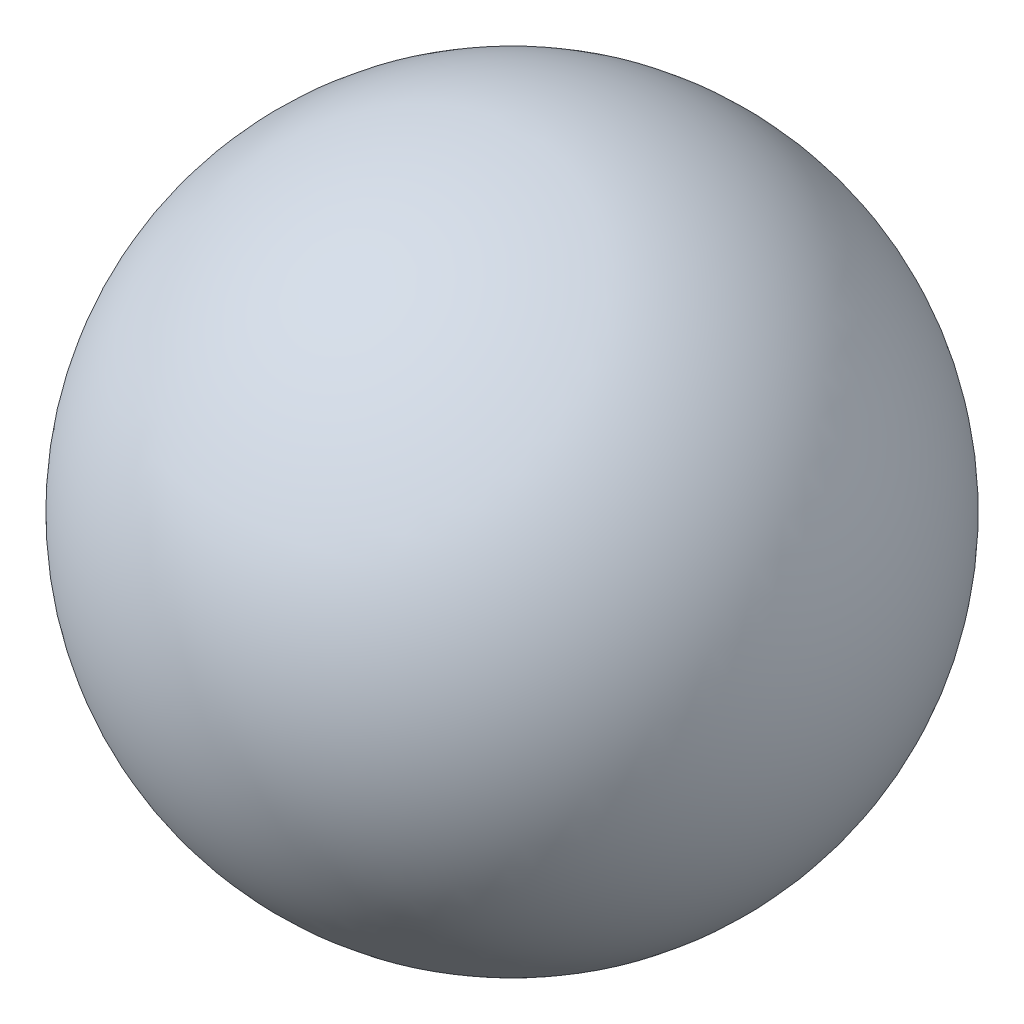
ISO-10303-21;
HEADER;
FILE_DESCRIPTION(('STEP AP214'),'2;1');
FILE_NAME('part.step','',(''),(''),'','','');
FILE_SCHEMA(('AUTOMOTIVE_DESIGN { 1 0 10303 214 1 1 1 1 }'));
ENDSEC;
DATA;
#1=APPLICATION_CONTEXT('core data for automotive mechanical design processes');
#2=APPLICATION_PROTOCOL_DEFINITION('international standard','automotive_design',2000,#1);
#3=PRODUCT_CONTEXT('',#1,'mechanical');
#4=PRODUCT('Part','Part','',(#3));
#5=PRODUCT_RELATED_PRODUCT_CATEGORY('part','',(#4));
#6=PRODUCT_DEFINITION_FORMATION('','',#4);
#7=PRODUCT_DEFINITION_CONTEXT('part definition',#1,'design');
#8=PRODUCT_DEFINITION('design','',#6,#7);
#9=PRODUCT_DEFINITION_SHAPE('','',#8);
#10=(LENGTH_UNIT() NAMED_UNIT(*) SI_UNIT(.MILLI.,.METRE.));
#11=(NAMED_UNIT(*) PLANE_ANGLE_UNIT() SI_UNIT($,.RADIAN.));
#12=(NAMED_UNIT(*) SI_UNIT($,.STERADIAN.) SOLID_ANGLE_UNIT());
#13=UNCERTAINTY_MEASURE_WITH_UNIT(LENGTH_MEASURE(1.E-05),#10,'distance_accuracy_value','');
#14=(GEOMETRIC_REPRESENTATION_CONTEXT(3) GLOBAL_UNCERTAINTY_ASSIGNED_CONTEXT((#13)) GLOBAL_UNIT_ASSIGNED_CONTEXT((#10,
#11,#12)) REPRESENTATION_CONTEXT('',''));
#15=CARTESIAN_POINT('',(0.,0.,0.));
#16=DIRECTION('',(0.,0.,1.));
#17=DIRECTION('',(1.,0.,0.));
#18=AXIS2_PLACEMENT_3D('',#15,#16,#17);
#19=CARTESIAN_POINT('',(0.,0.,0.));
#20=DIRECTION('',(0.,1.,0.));
#21=DIRECTION('',(-1.,0.,0.));
#22=AXIS2_PLACEMENT_3D('',#19,#20,#21);
#23=SPHERICAL_SURFACE('',#22,10.);
#24=CARTESIAN_POINT('',(0.,10.,0.));
#25=VERTEX_POINT('',#24);
#26=VERTEX_LOOP('',#25);
#27=FACE_BOUND('',#26,.T.);
#28=ADVANCED_FACE('F47',(#27),#23,.T.);
#29=CLOSED_SHELL('',(#28));
#30=MANIFOLD_SOLID_BREP('B2',#29);
#31=CARTESIAN_POINT('',(5.,5.,2.5));
#32=DIRECTION('',(-1.,0.,0.));
#33=DIRECTION('',(0.,-1.,0.));
#34=AXIS2_PLACEMENT_3D('',#31,#32,#33);
#35=PLANE('',#34);
#36=DIRECTION('',(0.,1.,0.));
#37=VECTOR('',#36,1.);
#38=CARTESIAN_POINT('',(5.,5.,-2.5));
#39=LINE('',#38,#37);
#40=CARTESIAN_POINT('',(5.,2.5,-2.5));
#41=VERTEX_POINT('',#40);
#42=CARTESIAN_POINT('',(5.,5.,-2.5));
#43=VERTEX_POINT('',#42);
#44=EDGE_CURVE('E186',#41,#43,#39,.T.);
#45=ORIENTED_EDGE('',*,*,#44,.T.);
#46=DIRECTION('',(0.,0.,-1.));
#47=VECTOR('',#46,1.);
#48=CARTESIAN_POINT('',(5.,5.,2.5));
#49=LINE('',#48,#47);
#50=CARTESIAN_POINT('',(5.,5.,2.5));
#51=VERTEX_POINT('',#50);
#52=EDGE_CURVE('E45',#51,#43,#49,.T.);
#53=ORIENTED_EDGE('',*,*,#52,.F.);
#54=DIRECTION('',(0.,1.,0.));
#55=VECTOR('',#54,1.);
#56=CARTESIAN_POINT('',(5.,5.,2.5));
#57=LINE('',#56,#55);
#58=CARTESIAN_POINT('',(5.,2.5,2.5));
#59=VERTEX_POINT('',#58);
#60=EDGE_CURVE('E214',#59,#51,#57,.T.);
#61=ORIENTED_EDGE('',*,*,#60,.F.);
#62=DIRECTION('',(0.,0.,-1.));
#63=VECTOR('',#62,1.);
#64=CARTESIAN_POINT('',(5.,2.5,2.5));
#65=LINE('',#64,#63);
#66=EDGE_CURVE('E182',#59,#41,#65,.T.);
#67=ORIENTED_EDGE('',*,*,#66,.T.);
#68=EDGE_LOOP('',(#45,#53,#61,#67));
#69=FACE_BOUND('',#68,.T.);
#70=ADVANCED_FACE('F61',(#69),#35,.F.);
#71=CARTESIAN_POINT('',(-1.875,5.,2.5));
#72=DIRECTION('',(0.,-1.,0.));
#73=DIRECTION('',(1.,0.,0.));
#74=AXIS2_PLACEMENT_3D('',#71,#72,#73);
#75=PLANE('',#74);
#76=DIRECTION('',(-1.,0.,0.));
#77=VECTOR('',#76,1.);
#78=CARTESIAN_POINT('',(-1.875,5.,-2.5));
#79=LINE('',#78,#77);
#80=CARTESIAN_POINT('',(-1.875,5.,-2.5));
#81=VERTEX_POINT('',#80);
#82=EDGE_CURVE('E189',#43,#81,#79,.T.);
#83=ORIENTED_EDGE('',*,*,#82,.T.);
#84=DIRECTION('',(0.,0.,-1.));
#85=VECTOR('',#84,1.);
#86=CARTESIAN_POINT('',(-1.875,5.,2.5));
#87=LINE('',#86,#85);
#88=CARTESIAN_POINT('',(-1.875,5.,2.5));
#89=VERTEX_POINT('',#88);
#90=EDGE_CURVE('E69',#89,#81,#87,.T.);
#91=ORIENTED_EDGE('',*,*,#90,.F.);
#92=DIRECTION('',(-1.,0.,0.));
#93=VECTOR('',#92,1.);
#94=CARTESIAN_POINT('',(-1.875,5.,2.5));
#95=LINE('',#94,#93);
#96=EDGE_CURVE('E135',#51,#89,#95,.T.);
#97=ORIENTED_EDGE('',*,*,#96,.F.);
#98=ORIENTED_EDGE('',*,*,#52,.T.);
#99=EDGE_LOOP('',(#83,#91,#97,#98));
#100=FACE_BOUND('',#99,.T.);
#101=ADVANCED_FACE('F278',(#100),#75,.F.);
#102=CARTESIAN_POINT('',(-1.875,1.875,2.5));
#103=DIRECTION('',(0.,0.,-1.));
#104=DIRECTION('',(-1.,0.,0.));
#105=AXIS2_PLACEMENT_3D('',#102,#103,#104);
#106=CYLINDRICAL_SURFACE('',#105,3.125);
#107=CARTESIAN_POINT('',(-1.875,1.875,-2.5));
#108=DIRECTION('',(0.,0.,1.));
#109=DIRECTION('',(-1.,0.,0.));
#110=AXIS2_PLACEMENT_3D('',#107,#108,#109);
#111=CIRCLE('',#110,3.125);
#112=CARTESIAN_POINT('',(-1.875,-1.25,-2.5));
#113=VERTEX_POINT('',#112);
#114=EDGE_CURVE('E191',#81,#113,#111,.T.);
#115=ORIENTED_EDGE('',*,*,#114,.T.);
#116=DIRECTION('',(0.,0.,-1.));
#117=VECTOR('',#116,1.);
#118=CARTESIAN_POINT('',(-1.875,-1.25,2.5));
#119=LINE('',#118,#117);
#120=CARTESIAN_POINT('',(-1.875,-1.25,2.5));
#121=VERTEX_POINT('',#120);
#122=EDGE_CURVE('E236',#121,#113,#119,.T.);
#123=ORIENTED_EDGE('',*,*,#122,.F.);
#124=CARTESIAN_POINT('',(-1.875,1.875,2.5));
#125=DIRECTION('',(0.,0.,1.));
#126=DIRECTION('',(-1.,0.,0.));
#127=AXIS2_PLACEMENT_3D('',#124,#125,#126);
#128=CIRCLE('',#127,3.125);
#129=EDGE_CURVE('E245',#89,#121,#128,.T.);
#130=ORIENTED_EDGE('',*,*,#129,.F.);
#131=ORIENTED_EDGE('',*,*,#90,.T.);
#132=EDGE_LOOP('',(#115,#123,#130,#131));
#133=FACE_BOUND('',#132,.T.);
#134=ADVANCED_FACE('F243',(#133),#106,.T.);
#135=CARTESIAN_POINT('',(1.875,-1.25,2.5));
#136=DIRECTION('',(0.,1.,0.));
#137=DIRECTION('',(0.,0.,1.));
#138=AXIS2_PLACEMENT_3D('',#135,#136,#137);
#139=PLANE('',#138);
#140=DIRECTION('',(1.,0.,0.));
#141=VECTOR('',#140,1.);
#142=CARTESIAN_POINT('',(1.875,-1.25,-2.5));
#143=LINE('',#142,#141);
#144=CARTESIAN_POINT('',(1.875,-1.25,-2.5));
#145=VERTEX_POINT('',#144);
#146=EDGE_CURVE('E195',#113,#145,#143,.T.);
#147=ORIENTED_EDGE('',*,*,#146,.T.);
#148=DIRECTION('',(0.,0.,-1.));
#149=VECTOR('',#148,1.);
#150=CARTESIAN_POINT('',(1.875,-1.25,2.5));
#151=LINE('',#150,#149);
#152=CARTESIAN_POINT('',(1.875,-1.25,2.5));
#153=VERTEX_POINT('',#152);
#154=EDGE_CURVE('E232',#153,#145,#151,.T.);
#155=ORIENTED_EDGE('',*,*,#154,.F.);
#156=DIRECTION('',(1.,0.,0.));
#157=VECTOR('',#156,1.);
#158=CARTESIAN_POINT('',(0.,-1.25,2.5));
#159=LINE('',#158,#157);
#160=EDGE_CURVE('E262',#121,#153,#159,.T.);
#161=ORIENTED_EDGE('',*,*,#160,.F.);
#162=ORIENTED_EDGE('',*,*,#122,.T.);
#163=EDGE_LOOP('',(#147,#155,#161,#162));
#164=FACE_BOUND('',#163,.T.);
#165=ADVANCED_FACE('F253',(#164),#139,.F.);
#166=CARTESIAN_POINT('',(1.875,-1.875,2.5));
#167=DIRECTION('',(0.,0.,-1.));
#168=DIRECTION('',(-1.,0.,0.));
#169=AXIS2_PLACEMENT_3D('',#166,#167,#168);
#170=CYLINDRICAL_SURFACE('',#169,0.625);
#171=CARTESIAN_POINT('',(1.875,-1.875,-2.5));
#172=DIRECTION('',(0.,0.,-1.));
#173=DIRECTION('',(-1.,0.,0.));
#174=AXIS2_PLACEMENT_3D('',#171,#172,#173);
#175=CIRCLE('',#174,0.625);
#176=CARTESIAN_POINT('',(1.875,-2.5,-2.5));
#177=VERTEX_POINT('',#176);
#178=EDGE_CURVE('E198',#145,#177,#175,.T.);
#179=ORIENTED_EDGE('',*,*,#178,.T.);
#180=DIRECTION('',(0.,0.,-1.));
#181=VECTOR('',#180,1.);
#182=CARTESIAN_POINT('',(1.875,-2.5,2.5));
#183=LINE('',#182,#181);
#184=CARTESIAN_POINT('',(1.875,-2.5,2.5));
#185=VERTEX_POINT('',#184);
#186=EDGE_CURVE('E229',#185,#177,#183,.T.);
#187=ORIENTED_EDGE('',*,*,#186,.F.);
#188=CARTESIAN_POINT('',(1.875,-1.875,2.5));
#189=DIRECTION('',(0.,0.,-1.));
#190=DIRECTION('',(-1.,0.,0.));
#191=AXIS2_PLACEMENT_3D('',#188,#189,#190);
#192=CIRCLE('',#191,0.625);
#193=EDGE_CURVE('E259',#153,#185,#192,.T.);
#194=ORIENTED_EDGE('',*,*,#193,.F.);
#195=ORIENTED_EDGE('',*,*,#154,.T.);
#196=EDGE_LOOP('',(#179,#187,#194,#195));
#197=FACE_BOUND('',#196,.T.);
#198=ADVANCED_FACE('F257',(#197),#170,.F.);
#199=CARTESIAN_POINT('',(1.875,-2.5,2.5));
#200=DIRECTION('',(0.,-1.,0.));
#201=DIRECTION('',(0.,0.,-1.));
#202=AXIS2_PLACEMENT_3D('',#199,#200,#201);
#203=PLANE('',#202);
#204=DIRECTION('',(-1.,0.,0.));
#205=VECTOR('',#204,1.);
#206=CARTESIAN_POINT('',(1.875,-2.5,-2.5));
#207=LINE('',#206,#205);
#208=CARTESIAN_POINT('',(-5.,-2.5,-2.5));
#209=VERTEX_POINT('',#208);
#210=EDGE_CURVE('E201',#177,#209,#207,.T.);
#211=ORIENTED_EDGE('',*,*,#210,.T.);
#212=DIRECTION('',(0.,0.,-1.));
#213=VECTOR('',#212,1.);
#214=CARTESIAN_POINT('',(-5.,-2.5,2.5));
#215=LINE('',#214,#213);
#216=CARTESIAN_POINT('',(-5.,-2.5,2.5));
#217=VERTEX_POINT('',#216);
#218=EDGE_CURVE('E226',#217,#209,#215,.T.);
#219=ORIENTED_EDGE('',*,*,#218,.F.);
#220=DIRECTION('',(-1.,0.,0.));
#221=VECTOR('',#220,1.);
#222=CARTESIAN_POINT('',(1.875,-2.5,2.5));
#223=LINE('',#222,#221);
#224=EDGE_CURVE('E261',#185,#217,#223,.T.);
#225=ORIENTED_EDGE('',*,*,#224,.F.);
#226=ORIENTED_EDGE('',*,*,#186,.T.);
#227=EDGE_LOOP('',(#211,#219,#225,#226));
#228=FACE_BOUND('',#227,.T.);
#229=ADVANCED_FACE('F290',(#228),#203,.F.);
#230=CARTESIAN_POINT('',(-5.,-2.5,2.5));
#231=DIRECTION('',(1.,0.,0.));
#232=DIRECTION('',(0.,1.,0.));
#233=AXIS2_PLACEMENT_3D('',#230,#231,#232);
#234=PLANE('',#233);
#235=DIRECTION('',(0.,-1.,0.));
#236=VECTOR('',#235,1.);
#237=CARTESIAN_POINT('',(-5.,-2.5,-2.5));
#238=LINE('',#237,#236);
#239=CARTESIAN_POINT('',(-5.,-5.,-2.5));
#240=VERTEX_POINT('',#239);
#241=EDGE_CURVE('E204',#209,#240,#238,.T.);
#242=ORIENTED_EDGE('',*,*,#241,.T.);
#243=DIRECTION('',(0.,0.,-1.));
#244=VECTOR('',#243,1.);
#245=CARTESIAN_POINT('',(-5.,-5.,2.5));
#246=LINE('',#245,#244);
#247=CARTESIAN_POINT('',(-5.,-5.,2.5));
#248=VERTEX_POINT('',#247);
#249=EDGE_CURVE('E223',#248,#240,#246,.T.);
#250=ORIENTED_EDGE('',*,*,#249,.F.);
#251=DIRECTION('',(0.,-1.,0.));
#252=VECTOR('',#251,1.);
#253=CARTESIAN_POINT('',(-5.,-2.5,2.5));
#254=LINE('',#253,#252);
#255=EDGE_CURVE('E264',#217,#248,#254,.T.);
#256=ORIENTED_EDGE('',*,*,#255,.F.);
#257=ORIENTED_EDGE('',*,*,#218,.T.);
#258=EDGE_LOOP('',(#242,#250,#256,#257));
#259=FACE_BOUND('',#258,.T.);
#260=ADVANCED_FACE('F293',(#259),#234,.F.);
#261=CARTESIAN_POINT('',(-5.,-5.,2.5));
#262=DIRECTION('',(0.,1.,0.));
#263=DIRECTION('',(0.,0.,1.));
#264=AXIS2_PLACEMENT_3D('',#261,#262,#263);
#265=PLANE('',#264);
#266=DIRECTION('',(1.,0.,0.));
#267=VECTOR('',#266,1.);
#268=CARTESIAN_POINT('',(-5.,-5.,-2.5));
#269=LINE('',#268,#267);
#270=CARTESIAN_POINT('',(1.875,-5.,-2.5));
#271=VERTEX_POINT('',#270);
#272=EDGE_CURVE('E206',#240,#271,#269,.T.);
#273=ORIENTED_EDGE('',*,*,#272,.T.);
#274=DIRECTION('',(0.,0.,-1.));
#275=VECTOR('',#274,1.);
#276=CARTESIAN_POINT('',(1.875,-5.,2.5));
#277=LINE('',#276,#275);
#278=CARTESIAN_POINT('',(1.875,-5.,2.5));
#279=VERTEX_POINT('',#278);
#280=EDGE_CURVE('E220',#279,#271,#277,.T.);
#281=ORIENTED_EDGE('',*,*,#280,.F.);
#282=DIRECTION('',(1.,0.,0.));
#283=VECTOR('',#282,1.);
#284=CARTESIAN_POINT('',(-5.,-5.,2.5));
#285=LINE('',#284,#283);
#286=EDGE_CURVE('E270',#248,#279,#285,.T.);
#287=ORIENTED_EDGE('',*,*,#286,.F.);
#288=ORIENTED_EDGE('',*,*,#249,.T.);
#289=EDGE_LOOP('',(#273,#281,#287,#288));
#290=FACE_BOUND('',#289,.T.);
#291=ADVANCED_FACE('F297',(#290),#265,.F.);
#292=CARTESIAN_POINT('',(1.875,-1.875,2.5));
#293=DIRECTION('',(0.,0.,-1.));
#294=DIRECTION('',(-1.,0.,0.));
#295=AXIS2_PLACEMENT_3D('',#292,#293,#294);
#296=CYLINDRICAL_SURFACE('',#295,3.125);
#297=CARTESIAN_POINT('',(1.875,-1.875,-2.5));
#298=DIRECTION('',(0.,0.,1.));
#299=DIRECTION('',(-1.,0.,0.));
#300=AXIS2_PLACEMENT_3D('',#297,#298,#299);
#301=CIRCLE('',#300,3.125);
#302=CARTESIAN_POINT('',(1.875,1.25,-2.5));
#303=VERTEX_POINT('',#302);
#304=EDGE_CURVE('E208',#271,#303,#301,.T.);
#305=ORIENTED_EDGE('',*,*,#304,.T.);
#306=DIRECTION('',(0.,0.,-1.));
#307=VECTOR('',#306,1.);
#308=CARTESIAN_POINT('',(1.875,1.25,2.5));
#309=LINE('',#308,#307);
#310=CARTESIAN_POINT('',(1.875,1.25,2.5));
#311=VERTEX_POINT('',#310);
#312=EDGE_CURVE('E176',#311,#303,#309,.T.);
#313=ORIENTED_EDGE('',*,*,#312,.F.);
#314=CARTESIAN_POINT('',(1.875,-1.875,2.5));
#315=DIRECTION('',(0.,0.,1.));
#316=DIRECTION('',(-1.,0.,0.));
#317=AXIS2_PLACEMENT_3D('',#314,#315,#316);
#318=CIRCLE('',#317,3.125);
#319=EDGE_CURVE('E167',#279,#311,#318,.T.);
#320=ORIENTED_EDGE('',*,*,#319,.F.);
#321=ORIENTED_EDGE('',*,*,#280,.T.);
#322=EDGE_LOOP('',(#305,#313,#320,#321));
#323=FACE_BOUND('',#322,.T.);
#324=ADVANCED_FACE('F301',(#323),#296,.T.);
#325=CARTESIAN_POINT('',(-1.875,1.25,2.5));
#326=DIRECTION('',(0.,-1.,0.));
#327=DIRECTION('',(0.,0.,-1.));
#328=AXIS2_PLACEMENT_3D('',#325,#326,#327);
#329=PLANE('',#328);
#330=DIRECTION('',(-1.,0.,0.));
#331=VECTOR('',#330,1.);
#332=CARTESIAN_POINT('',(-1.875,1.25,-2.5));
#333=LINE('',#332,#331);
#334=CARTESIAN_POINT('',(-1.875,1.25,-2.5));
#335=VERTEX_POINT('',#334);
#336=EDGE_CURVE('E175',#303,#335,#333,.T.);
#337=ORIENTED_EDGE('',*,*,#336,.T.);
#338=DIRECTION('',(0.,0.,-1.));
#339=VECTOR('',#338,1.);
#340=CARTESIAN_POINT('',(-1.875,1.25,2.5));
#341=LINE('',#340,#339);
#342=CARTESIAN_POINT('',(-1.875,1.25,2.5));
#343=VERTEX_POINT('',#342);
#344=EDGE_CURVE('E173',#343,#335,#341,.T.);
#345=ORIENTED_EDGE('',*,*,#344,.F.);
#346=DIRECTION('',(-1.,0.,0.));
#347=VECTOR('',#346,1.);
#348=CARTESIAN_POINT('',(0.,1.25,2.5));
#349=LINE('',#348,#347);
#350=EDGE_CURVE('E161',#311,#343,#349,.T.);
#351=ORIENTED_EDGE('',*,*,#350,.F.);
#352=ORIENTED_EDGE('',*,*,#312,.T.);
#353=EDGE_LOOP('',(#337,#345,#351,#352));
#354=FACE_BOUND('',#353,.T.);
#355=ADVANCED_FACE('F174',(#354),#329,.F.);
#356=CARTESIAN_POINT('',(-1.875,1.875,2.5));
#357=DIRECTION('',(0.,0.,-1.));
#358=DIRECTION('',(-1.,0.,0.));
#359=AXIS2_PLACEMENT_3D('',#356,#357,#358);
#360=CYLINDRICAL_SURFACE('',#359,0.625);
#361=CARTESIAN_POINT('',(-1.875,1.875,-2.5));
#362=DIRECTION('',(0.,0.,-1.));
#363=DIRECTION('',(1.,0.,0.));
#364=AXIS2_PLACEMENT_3D('',#361,#362,#363);
#365=CIRCLE('',#364,0.625);
#366=CARTESIAN_POINT('',(-1.875,2.5,-2.5));
#367=VERTEX_POINT('',#366);
#368=EDGE_CURVE('E121',#335,#367,#365,.T.);
#369=ORIENTED_EDGE('',*,*,#368,.T.);
#370=DIRECTION('',(0.,0.,-1.));
#371=VECTOR('',#370,1.);
#372=CARTESIAN_POINT('',(-1.875,2.5,2.5));
#373=LINE('',#372,#371);
#374=CARTESIAN_POINT('',(-1.875,2.5,2.5));
#375=VERTEX_POINT('',#374);
#376=EDGE_CURVE('E177',#375,#367,#373,.T.);
#377=ORIENTED_EDGE('',*,*,#376,.F.);
#378=CARTESIAN_POINT('',(-1.875,1.875,2.5));
#379=DIRECTION('',(0.,0.,-1.));
#380=DIRECTION('',(1.,0.,0.));
#381=AXIS2_PLACEMENT_3D('',#378,#379,#380);
#382=CIRCLE('',#381,0.625);
#383=EDGE_CURVE('E165',#343,#375,#382,.T.);
#384=ORIENTED_EDGE('',*,*,#383,.F.);
#385=ORIENTED_EDGE('',*,*,#344,.T.);
#386=EDGE_LOOP('',(#369,#377,#384,#385));
#387=FACE_BOUND('',#386,.T.);
#388=ADVANCED_FACE('F179',(#387),#360,.F.);
#389=CARTESIAN_POINT('',(5.,2.5,2.5));
#390=DIRECTION('',(0.,1.,0.));
#391=DIRECTION('',(-1.,0.,0.));
#392=AXIS2_PLACEMENT_3D('',#389,#390,#391);
#393=PLANE('',#392);
#394=DIRECTION('',(1.,0.,0.));
#395=VECTOR('',#394,1.);
#396=CARTESIAN_POINT('',(5.,2.5,-2.5));
#397=LINE('',#396,#395);
#398=EDGE_CURVE('E127',#367,#41,#397,.T.);
#399=ORIENTED_EDGE('',*,*,#398,.T.);
#400=ORIENTED_EDGE('',*,*,#66,.F.);
#401=DIRECTION('',(1.,0.,0.));
#402=VECTOR('',#401,1.);
#403=CARTESIAN_POINT('',(5.,2.5,2.5));
#404=LINE('',#403,#402);
#405=EDGE_CURVE('E80',#375,#59,#404,.T.);
#406=ORIENTED_EDGE('',*,*,#405,.F.);
#407=ORIENTED_EDGE('',*,*,#376,.T.);
#408=EDGE_LOOP('',(#399,#400,#406,#407));
#409=FACE_BOUND('',#408,.T.);
#410=ADVANCED_FACE('F310',(#409),#393,.F.);
#411=CARTESIAN_POINT('',(-1.875,1.875,2.5));
#412=DIRECTION('',(0.,0.,1.));
#413=DIRECTION('',(1.,0.,0.));
#414=AXIS2_PLACEMENT_3D('',#411,#412,#413);
#415=PLANE('',#414);
#416=ORIENTED_EDGE('',*,*,#60,.T.);
#417=ORIENTED_EDGE('',*,*,#96,.T.);
#418=ORIENTED_EDGE('',*,*,#129,.T.);
#419=ORIENTED_EDGE('',*,*,#160,.T.);
#420=ORIENTED_EDGE('',*,*,#193,.T.);
#421=ORIENTED_EDGE('',*,*,#224,.T.);
#422=ORIENTED_EDGE('',*,*,#255,.T.);
#423=ORIENTED_EDGE('',*,*,#286,.T.);
#424=ORIENTED_EDGE('',*,*,#319,.T.);
#425=ORIENTED_EDGE('',*,*,#350,.T.);
#426=ORIENTED_EDGE('',*,*,#383,.T.);
#427=ORIENTED_EDGE('',*,*,#405,.T.);
#428=EDGE_LOOP('',(#416,#417,#418,#419,#420,#421,#422,#423,#424,#425,#426,#427));
#429=FACE_BOUND('',#428,.T.);
#430=ADVANCED_FACE('F163',(#429),#415,.T.);
#431=CARTESIAN_POINT('',(-1.875,1.875,-2.5));
#432=DIRECTION('',(0.,0.,1.));
#433=DIRECTION('',(1.,0.,0.));
#434=AXIS2_PLACEMENT_3D('',#431,#432,#433);
#435=PLANE('',#434);
#436=ORIENTED_EDGE('',*,*,#44,.F.);
#437=ORIENTED_EDGE('',*,*,#398,.F.);
#438=ORIENTED_EDGE('',*,*,#368,.F.);
#439=ORIENTED_EDGE('',*,*,#336,.F.);
#440=ORIENTED_EDGE('',*,*,#304,.F.);
#441=ORIENTED_EDGE('',*,*,#272,.F.);
#442=ORIENTED_EDGE('',*,*,#241,.F.);
#443=ORIENTED_EDGE('',*,*,#210,.F.);
#444=ORIENTED_EDGE('',*,*,#178,.F.);
#445=ORIENTED_EDGE('',*,*,#146,.F.);
#446=ORIENTED_EDGE('',*,*,#114,.F.);
#447=ORIENTED_EDGE('',*,*,#82,.F.);
#448=EDGE_LOOP('',(#436,#437,#438,#439,#440,#441,#442,#443,#444,#445,#446,#447));
#449=FACE_BOUND('',#448,.T.);
#450=ADVANCED_FACE('F248',(#449),#435,.F.);
#451=CLOSED_SHELL('',(#70,#101,#134,#165,#198,#229,#260,#291,#324,#355,#388,#410,#430,#450));
#452=MANIFOLD_SOLID_BREP('B6',#451);
#453=ADVANCED_BREP_SHAPE_REPRESENTATION('',(#18,#30,#452),#14);
#454=SHAPE_DEFINITION_REPRESENTATION(#9,#453);
ENDSEC;
END-ISO-10303-21;
